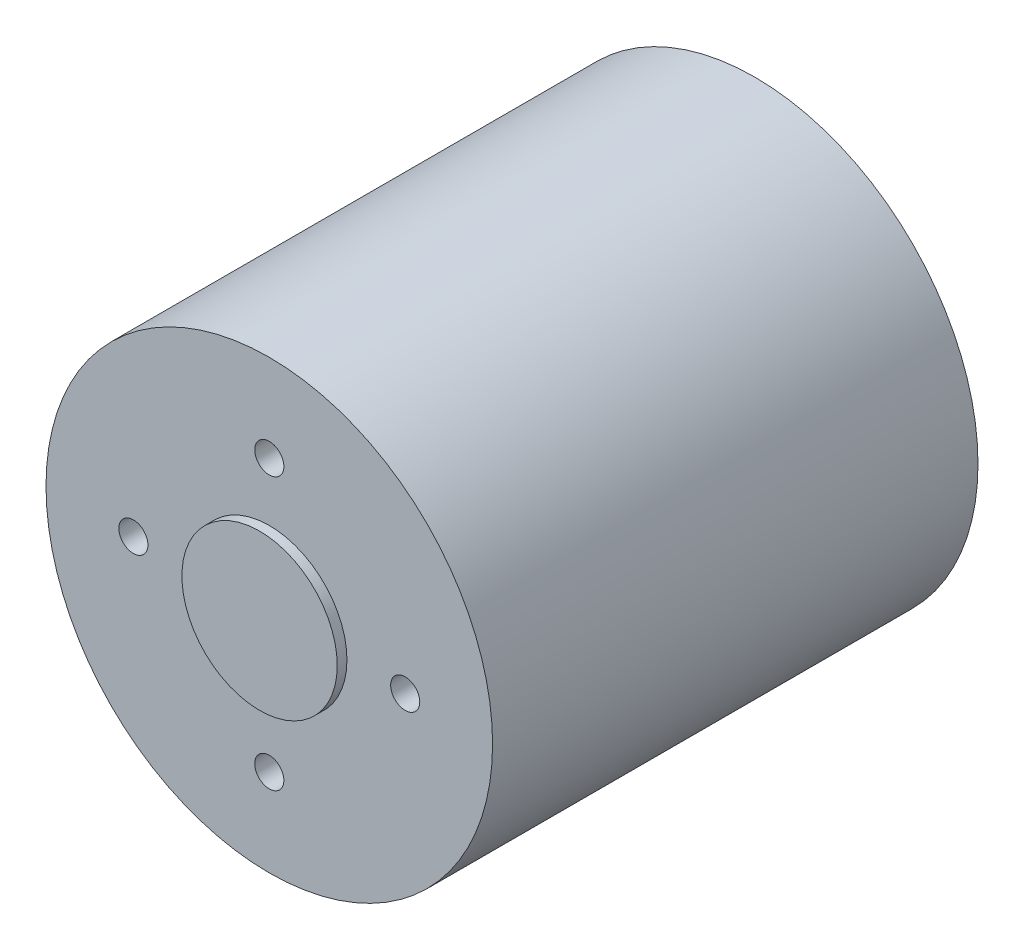
ISO-10303-21;
HEADER;
FILE_DESCRIPTION(('STEP AP214'),'2;1');
FILE_NAME('part.step','',(''),(''),'','','');
FILE_SCHEMA(('AUTOMOTIVE_DESIGN { 1 0 10303 214 1 1 1 1 }'));
ENDSEC;
DATA;
#1=APPLICATION_CONTEXT('core data for automotive mechanical design processes');
#2=APPLICATION_PROTOCOL_DEFINITION('international standard','automotive_design',2000,#1);
#3=PRODUCT_CONTEXT('',#1,'mechanical');
#4=PRODUCT('Part','Part','',(#3));
#5=PRODUCT_RELATED_PRODUCT_CATEGORY('part','',(#4));
#6=PRODUCT_DEFINITION_FORMATION('','',#4);
#7=PRODUCT_DEFINITION_CONTEXT('part definition',#1,'design');
#8=PRODUCT_DEFINITION('design','',#6,#7);
#9=PRODUCT_DEFINITION_SHAPE('','',#8);
#10=(LENGTH_UNIT() NAMED_UNIT(*) SI_UNIT(.MILLI.,.METRE.));
#11=(NAMED_UNIT(*) PLANE_ANGLE_UNIT() SI_UNIT($,.RADIAN.));
#12=(NAMED_UNIT(*) SI_UNIT($,.STERADIAN.) SOLID_ANGLE_UNIT());
#13=UNCERTAINTY_MEASURE_WITH_UNIT(LENGTH_MEASURE(1.E-05),#10,'distance_accuracy_value','');
#14=(GEOMETRIC_REPRESENTATION_CONTEXT(3) GLOBAL_UNCERTAINTY_ASSIGNED_CONTEXT((#13)) GLOBAL_UNIT_ASSIGNED_CONTEXT((#10,
#11,#12)) REPRESENTATION_CONTEXT('',''));
#15=CARTESIAN_POINT('',(0.,0.,0.));
#16=DIRECTION('',(0.,0.,1.));
#17=DIRECTION('',(1.,0.,0.));
#18=AXIS2_PLACEMENT_3D('',#15,#16,#17);
#19=CARTESIAN_POINT('',(0.,0.,-50.));
#20=DIRECTION('',(0.,0.,1.));
#21=DIRECTION('',(1.,0.,0.));
#22=AXIS2_PLACEMENT_3D('',#19,#20,#21);
#23=CYLINDRICAL_SURFACE('',#22,23.);
#24=CARTESIAN_POINT('',(0.,0.,-50.));
#25=DIRECTION('',(0.,0.,1.));
#26=DIRECTION('',(1.,0.,0.));
#27=AXIS2_PLACEMENT_3D('',#24,#25,#26);
#28=CIRCLE('',#27,23.);
#29=CARTESIAN_POINT('',(23.,0.,-50.));
#30=VERTEX_POINT('',#29);
#31=EDGE_CURVE('E130',#30,#30,#28,.T.);
#32=ORIENTED_EDGE('',*,*,#31,.T.);
#33=EDGE_LOOP('',(#32));
#34=FACE_BOUND('',#33,.T.);
#35=CARTESIAN_POINT('',(0.,0.,0.));
#36=DIRECTION('',(0.,0.,1.));
#37=DIRECTION('',(1.,0.,0.));
#38=AXIS2_PLACEMENT_3D('',#35,#36,#37);
#39=CIRCLE('',#38,23.);
#40=CARTESIAN_POINT('',(23.,0.,0.));
#41=VERTEX_POINT('',#40);
#42=EDGE_CURVE('E126',#41,#41,#39,.T.);
#43=ORIENTED_EDGE('',*,*,#42,.F.);
#44=EDGE_LOOP('',(#43));
#45=FACE_BOUND('',#44,.T.);
#46=ADVANCED_FACE('F37',(#34,#45),#23,.T.);
#47=CARTESIAN_POINT('',(0.,0.,-50.));
#48=DIRECTION('',(0.,0.,1.));
#49=DIRECTION('',(1.,0.,0.));
#50=AXIS2_PLACEMENT_3D('',#47,#48,#49);
#51=PLANE('',#50);
#52=CARTESIAN_POINT('',(0.,0.,-50.));
#53=DIRECTION('',(0.,0.,1.));
#54=DIRECTION('',(1.,0.,0.));
#55=AXIS2_PLACEMENT_3D('',#52,#53,#54);
#56=CIRCLE('',#55,5.);
#57=CARTESIAN_POINT('',(5.,0.,-50.));
#58=VERTEX_POINT('',#57);
#59=EDGE_CURVE('E40',#58,#58,#56,.F.);
#60=ORIENTED_EDGE('',*,*,#59,.F.);
#61=EDGE_LOOP('',(#60));
#62=FACE_BOUND('',#61,.T.);
#63=CARTESIAN_POINT('',(0.,12.5,-50.));
#64=DIRECTION('',(0.,0.,-1.));
#65=DIRECTION('',(0.,-1.,0.));
#66=AXIS2_PLACEMENT_3D('',#63,#64,#65);
#67=CIRCLE('',#66,1.5);
#68=CARTESIAN_POINT('',(0.,11.,-50.));
#69=VERTEX_POINT('',#68);
#70=EDGE_CURVE('E64',#69,#69,#67,.T.);
#71=ORIENTED_EDGE('',*,*,#70,.F.);
#72=EDGE_LOOP('',(#71));
#73=FACE_BOUND('',#72,.T.);
#74=CARTESIAN_POINT('',(-12.5,0.,-50.));
#75=DIRECTION('',(0.,0.,-1.));
#76=DIRECTION('',(1.,0.,0.));
#77=AXIS2_PLACEMENT_3D('',#74,#75,#76);
#78=CIRCLE('',#77,1.5);
#79=CARTESIAN_POINT('',(-11.,0.,-50.));
#80=VERTEX_POINT('',#79);
#81=EDGE_CURVE('E72',#80,#80,#78,.T.);
#82=ORIENTED_EDGE('',*,*,#81,.F.);
#83=EDGE_LOOP('',(#82));
#84=FACE_BOUND('',#83,.T.);
#85=CARTESIAN_POINT('',(1.30930550206618E-13,-12.5,-50.));
#86=DIRECTION('',(0.,0.,-1.));
#87=DIRECTION('',(0.,1.,0.));
#88=AXIS2_PLACEMENT_3D('',#85,#86,#87);
#89=CIRCLE('',#88,1.5);
#90=CARTESIAN_POINT('',(1.15218884181823E-13,-11.,-50.));
#91=VERTEX_POINT('',#90);
#92=EDGE_CURVE('E58',#91,#91,#89,.T.);
#93=ORIENTED_EDGE('',*,*,#92,.F.);
#94=EDGE_LOOP('',(#93));
#95=FACE_BOUND('',#94,.T.);
#96=CARTESIAN_POINT('',(12.5,0.,-50.));
#97=DIRECTION('',(0.,0.,-1.));
#98=DIRECTION('',(-1.,0.,0.));
#99=AXIS2_PLACEMENT_3D('',#96,#97,#98);
#100=CIRCLE('',#99,1.5);
#101=CARTESIAN_POINT('',(11.,0.,-50.));
#102=VERTEX_POINT('',#101);
#103=EDGE_CURVE('E111',#102,#102,#100,.T.);
#104=ORIENTED_EDGE('',*,*,#103,.F.);
#105=EDGE_LOOP('',(#104));
#106=FACE_BOUND('',#105,.T.);
#107=ORIENTED_EDGE('',*,*,#31,.F.);
#108=EDGE_LOOP('',(#107));
#109=FACE_BOUND('',#108,.T.);
#110=ADVANCED_FACE('F140',(#62,#73,#84,#95,#106,#109),#51,.F.);
#111=CARTESIAN_POINT('',(0.,0.,0.));
#112=DIRECTION('',(0.,0.,1.));
#113=DIRECTION('',(1.,0.,0.));
#114=AXIS2_PLACEMENT_3D('',#111,#112,#113);
#115=PLANE('',#114);
#116=CARTESIAN_POINT('',(-14.,0.,0.));
#117=DIRECTION('',(0.,0.,1.));
#118=DIRECTION('',(0.,1.,0.));
#119=AXIS2_PLACEMENT_3D('',#116,#117,#118);
#120=CIRCLE('',#119,1.5);
#121=CARTESIAN_POINT('',(-14.,1.49999999999995,0.));
#122=VERTEX_POINT('',#121);
#123=EDGE_CURVE('E88',#122,#122,#120,.T.);
#124=ORIENTED_EDGE('',*,*,#123,.F.);
#125=EDGE_LOOP('',(#124));
#126=FACE_BOUND('',#125,.T.);
#127=CARTESIAN_POINT('',(0.,-14.,0.));
#128=DIRECTION('',(0.,0.,1.));
#129=DIRECTION('',(-1.,0.,0.));
#130=AXIS2_PLACEMENT_3D('',#127,#128,#129);
#131=CIRCLE('',#130,1.5);
#132=CARTESIAN_POINT('',(-1.5,-14.,0.));
#133=VERTEX_POINT('',#132);
#134=EDGE_CURVE('E96',#133,#133,#131,.T.);
#135=ORIENTED_EDGE('',*,*,#134,.F.);
#136=EDGE_LOOP('',(#135));
#137=FACE_BOUND('',#136,.T.);
#138=CARTESIAN_POINT('',(14.,1.46642216231412E-13,0.));
#139=DIRECTION('',(0.,0.,1.));
#140=DIRECTION('',(0.,-1.,0.));
#141=AXIS2_PLACEMENT_3D('',#138,#139,#140);
#142=CIRCLE('',#141,1.5);
#143=CARTESIAN_POINT('',(14.,-1.49999999999985,0.));
#144=VERTEX_POINT('',#143);
#145=EDGE_CURVE('E63',#144,#144,#142,.T.);
#146=ORIENTED_EDGE('',*,*,#145,.F.);
#147=EDGE_LOOP('',(#146));
#148=FACE_BOUND('',#147,.T.);
#149=CARTESIAN_POINT('',(0.,14.,0.));
#150=DIRECTION('',(0.,0.,1.));
#151=DIRECTION('',(1.,0.,0.));
#152=AXIS2_PLACEMENT_3D('',#149,#150,#151);
#153=CIRCLE('',#152,1.5);
#154=CARTESIAN_POINT('',(1.5,14.,0.));
#155=VERTEX_POINT('',#154);
#156=EDGE_CURVE('E87',#155,#155,#153,.T.);
#157=ORIENTED_EDGE('',*,*,#156,.F.);
#158=EDGE_LOOP('',(#157));
#159=FACE_BOUND('',#158,.T.);
#160=CARTESIAN_POINT('',(0.,0.,0.));
#161=DIRECTION('',(0.,0.,1.));
#162=DIRECTION('',(1.,0.,0.));
#163=AXIS2_PLACEMENT_3D('',#160,#161,#162);
#164=CIRCLE('',#163,8.);
#165=CARTESIAN_POINT('',(8.,0.,0.));
#166=VERTEX_POINT('',#165);
#167=EDGE_CURVE('E50',#166,#166,#164,.T.);
#168=ORIENTED_EDGE('',*,*,#167,.F.);
#169=EDGE_LOOP('',(#168));
#170=FACE_BOUND('',#169,.T.);
#171=ORIENTED_EDGE('',*,*,#42,.T.);
#172=EDGE_LOOP('',(#171));
#173=FACE_BOUND('',#172,.T.);
#174=ADVANCED_FACE('F137',(#126,#137,#148,#159,#170,#173),#115,.T.);
#175=CARTESIAN_POINT('',(0.,0.,1.));
#176=DIRECTION('',(0.,0.,-1.));
#177=DIRECTION('',(-1.,0.,0.));
#178=AXIS2_PLACEMENT_3D('',#175,#176,#177);
#179=CYLINDRICAL_SURFACE('',#178,8.);
#180=CARTESIAN_POINT('',(0.,0.,1.));
#181=DIRECTION('',(0.,0.,1.));
#182=DIRECTION('',(1.,0.,0.));
#183=AXIS2_PLACEMENT_3D('',#180,#181,#182);
#184=CIRCLE('',#183,8.);
#185=CARTESIAN_POINT('',(8.,0.,1.));
#186=VERTEX_POINT('',#185);
#187=EDGE_CURVE('E119',#186,#186,#184,.T.);
#188=ORIENTED_EDGE('',*,*,#187,.F.);
#189=EDGE_LOOP('',(#188));
#190=FACE_BOUND('',#189,.T.);
#191=ORIENTED_EDGE('',*,*,#167,.T.);
#192=EDGE_LOOP('',(#191));
#193=FACE_BOUND('',#192,.T.);
#194=ADVANCED_FACE('F152',(#190,#193),#179,.T.);
#195=CARTESIAN_POINT('',(0.,0.,1.));
#196=DIRECTION('',(0.,0.,1.));
#197=DIRECTION('',(1.,0.,0.));
#198=AXIS2_PLACEMENT_3D('',#195,#196,#197);
#199=PLANE('',#198);
#200=ORIENTED_EDGE('',*,*,#187,.T.);
#201=EDGE_LOOP('',(#200));
#202=FACE_BOUND('',#201,.T.);
#203=ADVANCED_FACE('F159',(#202),#199,.T.);
#204=CARTESIAN_POINT('',(12.5,0.,-40.));
#205=DIRECTION('',(0.,0.,-1.));
#206=DIRECTION('',(-1.,0.,0.));
#207=AXIS2_PLACEMENT_3D('',#204,#205,#206);
#208=CYLINDRICAL_SURFACE('',#207,1.5);
#209=CARTESIAN_POINT('',(12.5,0.,-40.));
#210=DIRECTION('',(0.,0.,-1.));
#211=DIRECTION('',(-1.,0.,0.));
#212=AXIS2_PLACEMENT_3D('',#209,#210,#211);
#213=CIRCLE('',#212,1.5);
#214=CARTESIAN_POINT('',(11.,0.,-40.));
#215=VERTEX_POINT('',#214);
#216=EDGE_CURVE('E115',#215,#215,#213,.T.);
#217=ORIENTED_EDGE('',*,*,#216,.F.);
#218=EDGE_LOOP('',(#217));
#219=FACE_BOUND('',#218,.T.);
#220=ORIENTED_EDGE('',*,*,#103,.T.);
#221=EDGE_LOOP('',(#220));
#222=FACE_BOUND('',#221,.T.);
#223=ADVANCED_FACE('F163',(#219,#222),#208,.F.);
#224=CARTESIAN_POINT('',(12.5,0.,-40.));
#225=DIRECTION('',(0.,0.,-1.));
#226=DIRECTION('',(-1.,0.,0.));
#227=AXIS2_PLACEMENT_3D('',#224,#225,#226);
#228=PLANE('',#227);
#229=ORIENTED_EDGE('',*,*,#216,.T.);
#230=EDGE_LOOP('',(#229));
#231=FACE_BOUND('',#230,.T.);
#232=ADVANCED_FACE('F167',(#231),#228,.T.);
#233=CARTESIAN_POINT('',(0.,14.,-5.));
#234=DIRECTION('',(0.,0.,1.));
#235=DIRECTION('',(1.,0.,0.));
#236=AXIS2_PLACEMENT_3D('',#233,#234,#235);
#237=CYLINDRICAL_SURFACE('',#236,1.5);
#238=CARTESIAN_POINT('',(0.,14.,-5.));
#239=DIRECTION('',(0.,0.,1.));
#240=DIRECTION('',(1.,0.,0.));
#241=AXIS2_PLACEMENT_3D('',#238,#239,#240);
#242=CIRCLE('',#241,1.5);
#243=CARTESIAN_POINT('',(1.5,14.,-5.));
#244=VERTEX_POINT('',#243);
#245=EDGE_CURVE('E107',#244,#244,#242,.T.);
#246=ORIENTED_EDGE('',*,*,#245,.F.);
#247=EDGE_LOOP('',(#246));
#248=FACE_BOUND('',#247,.T.);
#249=ORIENTED_EDGE('',*,*,#156,.T.);
#250=EDGE_LOOP('',(#249));
#251=FACE_BOUND('',#250,.T.);
#252=ADVANCED_FACE('F171',(#248,#251),#237,.F.);
#253=CARTESIAN_POINT('',(0.,14.,-5.));
#254=DIRECTION('',(0.,0.,1.));
#255=DIRECTION('',(1.,0.,0.));
#256=AXIS2_PLACEMENT_3D('',#253,#254,#255);
#257=PLANE('',#256);
#258=ORIENTED_EDGE('',*,*,#245,.T.);
#259=EDGE_LOOP('',(#258));
#260=FACE_BOUND('',#259,.T.);
#261=ADVANCED_FACE('F175',(#260),#257,.T.);
#262=CARTESIAN_POINT('',(14.,1.46642216231412E-13,-5.));
#263=DIRECTION('',(0.,0.,1.));
#264=DIRECTION('',(1.,0.,0.));
#265=AXIS2_PLACEMENT_3D('',#262,#263,#264);
#266=CYLINDRICAL_SURFACE('',#265,1.5);
#267=CARTESIAN_POINT('',(14.,1.46642216231412E-13,-5.));
#268=DIRECTION('',(0.,0.,1.));
#269=DIRECTION('',(0.,-1.,0.));
#270=AXIS2_PLACEMENT_3D('',#267,#268,#269);
#271=CIRCLE('',#270,1.5);
#272=CARTESIAN_POINT('',(14.,-1.49999999999985,-5.));
#273=VERTEX_POINT('',#272);
#274=EDGE_CURVE('E100',#273,#273,#271,.T.);
#275=ORIENTED_EDGE('',*,*,#274,.F.);
#276=EDGE_LOOP('',(#275));
#277=FACE_BOUND('',#276,.T.);
#278=ORIENTED_EDGE('',*,*,#145,.T.);
#279=EDGE_LOOP('',(#278));
#280=FACE_BOUND('',#279,.T.);
#281=ADVANCED_FACE('F179',(#277,#280),#266,.F.);
#282=CARTESIAN_POINT('',(14.,1.46642216231412E-13,-5.));
#283=DIRECTION('',(0.,0.,1.));
#284=DIRECTION('',(0.,-1.,0.));
#285=AXIS2_PLACEMENT_3D('',#282,#283,#284);
#286=PLANE('',#285);
#287=ORIENTED_EDGE('',*,*,#274,.T.);
#288=EDGE_LOOP('',(#287));
#289=FACE_BOUND('',#288,.T.);
#290=ADVANCED_FACE('F183',(#289),#286,.T.);
#291=CARTESIAN_POINT('',(0.,-14.,-5.));
#292=DIRECTION('',(0.,0.,1.));
#293=DIRECTION('',(1.,0.,0.));
#294=AXIS2_PLACEMENT_3D('',#291,#292,#293);
#295=CYLINDRICAL_SURFACE('',#294,1.5);
#296=CARTESIAN_POINT('',(0.,-14.,-5.));
#297=DIRECTION('',(0.,0.,1.));
#298=DIRECTION('',(-1.,0.,0.));
#299=AXIS2_PLACEMENT_3D('',#296,#297,#298);
#300=CIRCLE('',#299,1.5);
#301=CARTESIAN_POINT('',(-1.5,-14.,-5.));
#302=VERTEX_POINT('',#301);
#303=EDGE_CURVE('E92',#302,#302,#300,.T.);
#304=ORIENTED_EDGE('',*,*,#303,.F.);
#305=EDGE_LOOP('',(#304));
#306=FACE_BOUND('',#305,.T.);
#307=ORIENTED_EDGE('',*,*,#134,.T.);
#308=EDGE_LOOP('',(#307));
#309=FACE_BOUND('',#308,.T.);
#310=ADVANCED_FACE('F187',(#306,#309),#295,.F.);
#311=CARTESIAN_POINT('',(0.,-14.,-5.));
#312=DIRECTION('',(0.,0.,1.));
#313=DIRECTION('',(-1.,0.,0.));
#314=AXIS2_PLACEMENT_3D('',#311,#312,#313);
#315=PLANE('',#314);
#316=ORIENTED_EDGE('',*,*,#303,.T.);
#317=EDGE_LOOP('',(#316));
#318=FACE_BOUND('',#317,.T.);
#319=ADVANCED_FACE('F191',(#318),#315,.T.);
#320=CARTESIAN_POINT('',(-14.,0.,-5.));
#321=DIRECTION('',(0.,0.,1.));
#322=DIRECTION('',(1.,0.,0.));
#323=AXIS2_PLACEMENT_3D('',#320,#321,#322);
#324=CYLINDRICAL_SURFACE('',#323,1.5);
#325=CARTESIAN_POINT('',(-14.,0.,-5.));
#326=DIRECTION('',(0.,0.,1.));
#327=DIRECTION('',(0.,1.,0.));
#328=AXIS2_PLACEMENT_3D('',#325,#326,#327);
#329=CIRCLE('',#328,1.5);
#330=CARTESIAN_POINT('',(-14.,1.49999999999995,-5.));
#331=VERTEX_POINT('',#330);
#332=EDGE_CURVE('E83',#331,#331,#329,.T.);
#333=ORIENTED_EDGE('',*,*,#332,.F.);
#334=EDGE_LOOP('',(#333));
#335=FACE_BOUND('',#334,.T.);
#336=ORIENTED_EDGE('',*,*,#123,.T.);
#337=EDGE_LOOP('',(#336));
#338=FACE_BOUND('',#337,.T.);
#339=ADVANCED_FACE('F195',(#335,#338),#324,.F.);
#340=CARTESIAN_POINT('',(-14.,0.,-5.));
#341=DIRECTION('',(0.,0.,1.));
#342=DIRECTION('',(0.,1.,0.));
#343=AXIS2_PLACEMENT_3D('',#340,#341,#342);
#344=PLANE('',#343);
#345=ORIENTED_EDGE('',*,*,#332,.T.);
#346=EDGE_LOOP('',(#345));
#347=FACE_BOUND('',#346,.T.);
#348=ADVANCED_FACE('F199',(#347),#344,.T.);
#349=CARTESIAN_POINT('',(1.30930550206618E-13,-12.5,-40.));
#350=DIRECTION('',(0.,0.,-1.));
#351=DIRECTION('',(-1.,0.,0.));
#352=AXIS2_PLACEMENT_3D('',#349,#350,#351);
#353=CYLINDRICAL_SURFACE('',#352,1.5);
#354=CARTESIAN_POINT('',(1.30930550206618E-13,-12.5,-40.));
#355=DIRECTION('',(0.,0.,-1.));
#356=DIRECTION('',(0.,1.,0.));
#357=AXIS2_PLACEMENT_3D('',#354,#355,#356);
#358=CIRCLE('',#357,1.5);
#359=CARTESIAN_POINT('',(1.15218884181823E-13,-11.,-40.));
#360=VERTEX_POINT('',#359);
#361=EDGE_CURVE('E76',#360,#360,#358,.T.);
#362=ORIENTED_EDGE('',*,*,#361,.F.);
#363=EDGE_LOOP('',(#362));
#364=FACE_BOUND('',#363,.T.);
#365=ORIENTED_EDGE('',*,*,#92,.T.);
#366=EDGE_LOOP('',(#365));
#367=FACE_BOUND('',#366,.T.);
#368=ADVANCED_FACE('F203',(#364,#367),#353,.F.);
#369=CARTESIAN_POINT('',(1.30930550206618E-13,-12.5,-40.));
#370=DIRECTION('',(0.,0.,-1.));
#371=DIRECTION('',(0.,1.,0.));
#372=AXIS2_PLACEMENT_3D('',#369,#370,#371);
#373=PLANE('',#372);
#374=ORIENTED_EDGE('',*,*,#361,.T.);
#375=EDGE_LOOP('',(#374));
#376=FACE_BOUND('',#375,.T.);
#377=ADVANCED_FACE('F207',(#376),#373,.T.);
#378=CARTESIAN_POINT('',(-12.5,0.,-40.));
#379=DIRECTION('',(0.,0.,-1.));
#380=DIRECTION('',(-1.,0.,0.));
#381=AXIS2_PLACEMENT_3D('',#378,#379,#380);
#382=CYLINDRICAL_SURFACE('',#381,1.5);
#383=CARTESIAN_POINT('',(-12.5,0.,-40.));
#384=DIRECTION('',(0.,0.,-1.));
#385=DIRECTION('',(1.,0.,0.));
#386=AXIS2_PLACEMENT_3D('',#383,#384,#385);
#387=CIRCLE('',#386,1.5);
#388=CARTESIAN_POINT('',(-11.,0.,-40.));
#389=VERTEX_POINT('',#388);
#390=EDGE_CURVE('E68',#389,#389,#387,.T.);
#391=ORIENTED_EDGE('',*,*,#390,.F.);
#392=EDGE_LOOP('',(#391));
#393=FACE_BOUND('',#392,.T.);
#394=ORIENTED_EDGE('',*,*,#81,.T.);
#395=EDGE_LOOP('',(#394));
#396=FACE_BOUND('',#395,.T.);
#397=ADVANCED_FACE('F211',(#393,#396),#382,.F.);
#398=CARTESIAN_POINT('',(-12.5,0.,-40.));
#399=DIRECTION('',(0.,0.,-1.));
#400=DIRECTION('',(1.,0.,0.));
#401=AXIS2_PLACEMENT_3D('',#398,#399,#400);
#402=PLANE('',#401);
#403=ORIENTED_EDGE('',*,*,#390,.T.);
#404=EDGE_LOOP('',(#403));
#405=FACE_BOUND('',#404,.T.);
#406=ADVANCED_FACE('F215',(#405),#402,.T.);
#407=CARTESIAN_POINT('',(0.,12.5,-40.));
#408=DIRECTION('',(0.,0.,-1.));
#409=DIRECTION('',(-1.,0.,0.));
#410=AXIS2_PLACEMENT_3D('',#407,#408,#409);
#411=CYLINDRICAL_SURFACE('',#410,1.5);
#412=CARTESIAN_POINT('',(0.,12.5,-40.));
#413=DIRECTION('',(0.,0.,-1.));
#414=DIRECTION('',(0.,-1.,0.));
#415=AXIS2_PLACEMENT_3D('',#412,#413,#414);
#416=CIRCLE('',#415,1.5);
#417=CARTESIAN_POINT('',(0.,11.,-40.));
#418=VERTEX_POINT('',#417);
#419=EDGE_CURVE('E59',#418,#418,#416,.T.);
#420=ORIENTED_EDGE('',*,*,#419,.F.);
#421=EDGE_LOOP('',(#420));
#422=FACE_BOUND('',#421,.T.);
#423=ORIENTED_EDGE('',*,*,#70,.T.);
#424=EDGE_LOOP('',(#423));
#425=FACE_BOUND('',#424,.T.);
#426=ADVANCED_FACE('F219',(#422,#425),#411,.F.);
#427=CARTESIAN_POINT('',(0.,12.5,-40.));
#428=DIRECTION('',(0.,0.,-1.));
#429=DIRECTION('',(0.,-1.,0.));
#430=AXIS2_PLACEMENT_3D('',#427,#428,#429);
#431=PLANE('',#430);
#432=ORIENTED_EDGE('',*,*,#419,.T.);
#433=EDGE_LOOP('',(#432));
#434=FACE_BOUND('',#433,.T.);
#435=ADVANCED_FACE('F223',(#434),#431,.T.);
#436=CARTESIAN_POINT('',(0.,0.,-55.));
#437=DIRECTION('',(0.,0.,1.));
#438=DIRECTION('',(1.,0.,0.));
#439=AXIS2_PLACEMENT_3D('',#436,#437,#438);
#440=CYLINDRICAL_SURFACE('',#439,5.);
#441=CARTESIAN_POINT('',(0.,0.,-55.));
#442=DIRECTION('',(0.,0.,-1.));
#443=DIRECTION('',(-1.,0.,0.));
#444=AXIS2_PLACEMENT_3D('',#441,#442,#443);
#445=CIRCLE('',#444,5.);
#446=CARTESIAN_POINT('',(-5.,0.,-55.));
#447=VERTEX_POINT('',#446);
#448=EDGE_CURVE('E54',#447,#447,#445,.T.);
#449=ORIENTED_EDGE('',*,*,#448,.F.);
#450=EDGE_LOOP('',(#449));
#451=FACE_BOUND('',#450,.T.);
#452=ORIENTED_EDGE('',*,*,#59,.T.);
#453=EDGE_LOOP('',(#452));
#454=FACE_BOUND('',#453,.T.);
#455=ADVANCED_FACE('F227',(#451,#454),#440,.T.);
#456=CARTESIAN_POINT('',(0.,0.,-55.));
#457=DIRECTION('',(0.,0.,-1.));
#458=DIRECTION('',(-1.,0.,0.));
#459=AXIS2_PLACEMENT_3D('',#456,#457,#458);
#460=PLANE('',#459);
#461=CARTESIAN_POINT('',(0.,0.,-55.));
#462=DIRECTION('',(0.,0.,-1.));
#463=DIRECTION('',(-1.,0.,0.));
#464=AXIS2_PLACEMENT_3D('',#461,#462,#463);
#465=CIRCLE('',#464,2.425);
#466=CARTESIAN_POINT('',(-2.425,0.,-55.));
#467=VERTEX_POINT('',#466);
#468=EDGE_CURVE('E10',#467,#467,#465,.T.);
#469=ORIENTED_EDGE('',*,*,#468,.F.);
#470=EDGE_LOOP('',(#469));
#471=FACE_BOUND('',#470,.T.);
#472=ORIENTED_EDGE('',*,*,#448,.T.);
#473=EDGE_LOOP('',(#472));
#474=FACE_BOUND('',#473,.T.);
#475=ADVANCED_FACE('F231',(#471,#474),#460,.T.);
#476=CARTESIAN_POINT('',(0.,0.,-60.));
#477=DIRECTION('',(0.,0.,1.));
#478=DIRECTION('',(1.,0.,0.));
#479=AXIS2_PLACEMENT_3D('',#476,#477,#478);
#480=CYLINDRICAL_SURFACE('',#479,2.425);
#481=CARTESIAN_POINT('',(0.,0.,-60.));
#482=DIRECTION('',(0.,0.,-1.));
#483=DIRECTION('',(-1.,0.,0.));
#484=AXIS2_PLACEMENT_3D('',#481,#482,#483);
#485=CIRCLE('',#484,2.425);
#486=CARTESIAN_POINT('',(-2.425,0.,-60.));
#487=VERTEX_POINT('',#486);
#488=EDGE_CURVE('E53',#487,#487,#485,.T.);
#489=ORIENTED_EDGE('',*,*,#488,.F.);
#490=EDGE_LOOP('',(#489));
#491=FACE_BOUND('',#490,.T.);
#492=ORIENTED_EDGE('',*,*,#468,.T.);
#493=EDGE_LOOP('',(#492));
#494=FACE_BOUND('',#493,.T.);
#495=ADVANCED_FACE('F235',(#491,#494),#480,.T.);
#496=CARTESIAN_POINT('',(0.,0.,-60.));
#497=DIRECTION('',(0.,0.,-1.));
#498=DIRECTION('',(-1.,0.,0.));
#499=AXIS2_PLACEMENT_3D('',#496,#497,#498);
#500=PLANE('',#499);
#501=ORIENTED_EDGE('',*,*,#488,.T.);
#502=EDGE_LOOP('',(#501));
#503=FACE_BOUND('',#502,.T.);
#504=ADVANCED_FACE('F239',(#503),#500,.T.);
#505=CLOSED_SHELL('',(#46,#110,#174,#194,#203,#223,#232,#252,#261,#281,#290,#310,#319,#339,#348,
#368,#377,#397,#406,#426,#435,#455,#475,#495,#504));
#506=MANIFOLD_SOLID_BREP('B2',#505);
#507=ADVANCED_BREP_SHAPE_REPRESENTATION('',(#18,#506),#14);
#508=SHAPE_DEFINITION_REPRESENTATION(#9,#507);
ENDSEC;
END-ISO-10303-21;
